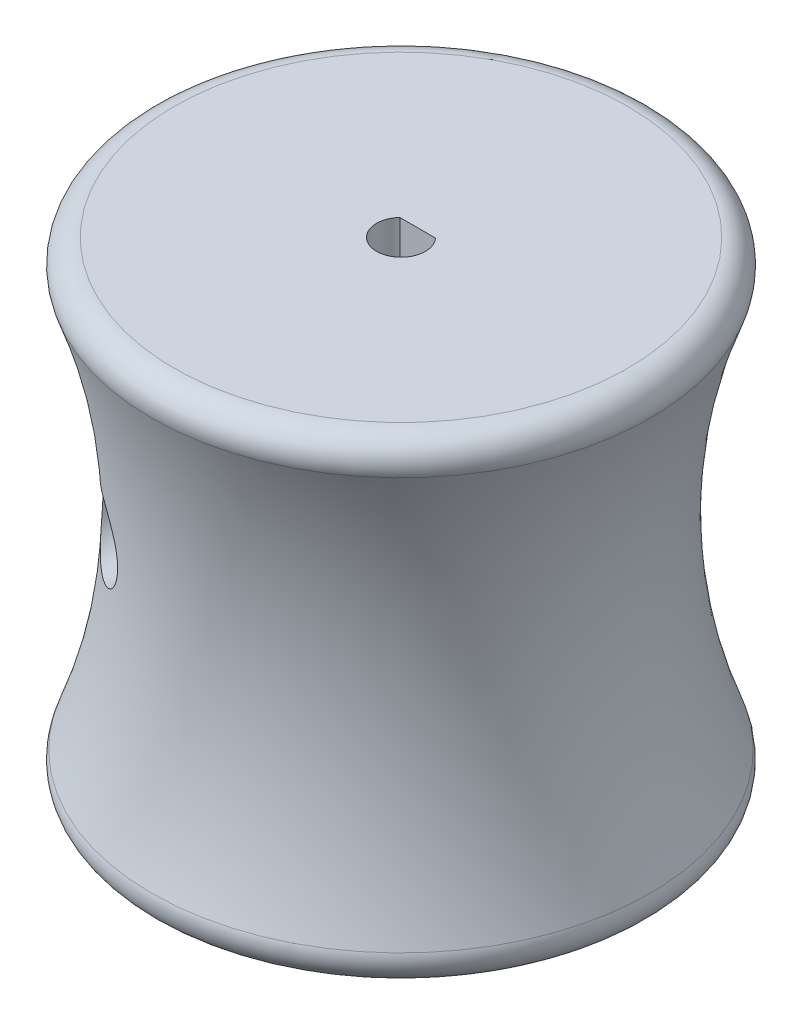
ISO-10303-21;
HEADER;
FILE_DESCRIPTION(('STEP AP214'),'2;1');
FILE_NAME('part.step','',(''),(''),'','','');
FILE_SCHEMA(('AUTOMOTIVE_DESIGN { 1 0 10303 214 1 1 1 1 }'));
ENDSEC;
DATA;
#1=APPLICATION_CONTEXT('core data for automotive mechanical design processes');
#2=APPLICATION_PROTOCOL_DEFINITION('international standard','automotive_design',2000,#1);
#3=PRODUCT_CONTEXT('',#1,'mechanical');
#4=PRODUCT('Part','Part','',(#3));
#5=PRODUCT_RELATED_PRODUCT_CATEGORY('part','',(#4));
#6=PRODUCT_DEFINITION_FORMATION('','',#4);
#7=PRODUCT_DEFINITION_CONTEXT('part definition',#1,'design');
#8=PRODUCT_DEFINITION('design','',#6,#7);
#9=PRODUCT_DEFINITION_SHAPE('','',#8);
#10=(LENGTH_UNIT() NAMED_UNIT(*) SI_UNIT(.MILLI.,.METRE.));
#11=(NAMED_UNIT(*) PLANE_ANGLE_UNIT() SI_UNIT($,.RADIAN.));
#12=(NAMED_UNIT(*) SI_UNIT($,.STERADIAN.) SOLID_ANGLE_UNIT());
#13=UNCERTAINTY_MEASURE_WITH_UNIT(LENGTH_MEASURE(1.E-05),#10,'distance_accuracy_value','');
#14=(GEOMETRIC_REPRESENTATION_CONTEXT(3) GLOBAL_UNCERTAINTY_ASSIGNED_CONTEXT((#13)) GLOBAL_UNIT_ASSIGNED_CONTEXT((#10,
#11,#12)) REPRESENTATION_CONTEXT('',''));
#15=CARTESIAN_POINT('',(0.,0.,0.));
#16=DIRECTION('',(0.,0.,1.));
#17=DIRECTION('',(1.,0.,0.));
#18=AXIS2_PLACEMENT_3D('',#15,#16,#17);
#19=CARTESIAN_POINT('',(-2.05,0.,0.));
#20=DIRECTION('',(0.,1.,0.));
#21=DIRECTION('',(0.,0.,1.));
#22=AXIS2_PLACEMENT_3D('',#19,#20,#21);
#23=PLANE('',#22);
#24=CARTESIAN_POINT('',(0.,0.,0.));
#25=DIRECTION('',(0.,1.,0.));
#26=DIRECTION('',(0.,0.,1.));
#27=AXIS2_PLACEMENT_3D('',#24,#25,#26);
#28=CIRCLE('',#27,19.0746635484357);
#29=CARTESIAN_POINT('',(0.,0.,19.0746635484357));
#30=VERTEX_POINT('',#29);
#31=EDGE_CURVE('E11',#30,#30,#28,.F.);
#32=ORIENTED_EDGE('',*,*,#31,.T.);
#33=EDGE_LOOP('',(#32));
#34=FACE_BOUND('',#33,.T.);
#35=CARTESIAN_POINT('',(0.,0.,0.));
#36=DIRECTION('',(0.,-1.,0.));
#37=DIRECTION('',(0.,0.,-1.));
#38=AXIS2_PLACEMENT_3D('',#35,#36,#37);
#39=CIRCLE('',#38,2.05);
#40=CARTESIAN_POINT('',(1.5,0.,-1.39731886124821));
#41=VERTEX_POINT('',#40);
#42=CARTESIAN_POINT('',(-1.5,0.,-1.39731886124821));
#43=VERTEX_POINT('',#42);
#44=EDGE_CURVE('E55',#41,#43,#39,.T.);
#45=ORIENTED_EDGE('',*,*,#44,.F.);
#46=DIRECTION('',(-1.,0.,0.));
#47=VECTOR('',#46,1.);
#48=CARTESIAN_POINT('',(-1.5,0.,-1.39731886124821));
#49=LINE('',#48,#47);
#50=EDGE_CURVE('E67',#41,#43,#49,.T.);
#51=ORIENTED_EDGE('',*,*,#50,.T.);
#52=EDGE_LOOP('',(#45,#51));
#53=FACE_BOUND('',#52,.T.);
#54=ADVANCED_FACE('F33',(#34,#53),#23,.F.);
#55=CARTESIAN_POINT('',(0.,20.,0.));
#56=DIRECTION('',(0.,-1.,0.));
#57=DIRECTION('',(0.,0.,-1.));
#58=AXIS2_PLACEMENT_3D('',#55,#56,#57);
#59=TOROIDAL_SURFACE('',#58,67.2000369326138,49.3814320875407);
#60=CARTESIAN_POINT('',(-8.41740148487917,18.2059411743486,-15.7420724041325));
#61=CARTESIAN_POINT('',(-8.32593708767405,18.328514955041,-15.7859282502121));
#62=CARTESIAN_POINT('',(-8.24297987107519,18.4593259564831,-15.8244350192102));
#63=CARTESIAN_POINT('',(-8.09745017921644,18.734362060283,-15.8906236835779));
#64=CARTESIAN_POINT('',(-8.03487312180446,18.8785841379881,-15.9183080124804));
#65=CARTESIAN_POINT('',(-7.93270419395248,19.1767579018185,-15.9629131088915));
#66=CARTESIAN_POINT('',(-7.89314315177229,19.3307223326519,-15.9798194429569));
#67=CARTESIAN_POINT('',(-7.83884067367383,19.6437642607484,-16.0029090430921));
#68=CARTESIAN_POINT('',(-7.82409956420845,19.8028418252358,-16.0090921681211));
#69=CARTESIAN_POINT('',(-7.82011242213963,20.1182935278861,-16.0107702149628));
#70=CARTESIAN_POINT('',(-7.83038053905276,20.2746606856367,-16.0064688167959));
#71=CARTESIAN_POINT('',(-7.87496804530724,20.5832720841031,-15.9875673809628));
#72=CARTESIAN_POINT('',(-7.90928546152177,20.735516661992,-15.9729681881795));
#73=CARTESIAN_POINT('',(-8.00045220886725,21.031327979962,-15.9334220557002));
#74=CARTESIAN_POINT('',(-8.0572561342106,21.1749115395835,-15.9084959638554));
#75=CARTESIAN_POINT('',(-8.19105800322196,21.4499449358191,-15.8482477781881));
#76=CARTESIAN_POINT('',(-8.26805637134713,21.5813945173166,-15.8129254658506));
#77=CARTESIAN_POINT('',(-8.44119856358103,21.8320084195719,-15.7310195718536));
#78=CARTESIAN_POINT('',(-8.53775342479176,21.9508071013989,-15.6841886048088));
#79=CARTESIAN_POINT('',(-8.74495309450607,22.1700889743099,-15.5801117766882));
#80=CARTESIAN_POINT('',(-8.85560059811625,22.2705686530686,-15.522863922565));
#81=CARTESIAN_POINT('',(-9.09429245109406,22.4576357962001,-15.3947100241208));
#82=CARTESIAN_POINT('',(-9.22299405516872,22.542946056912,-15.323169957364));
#83=CARTESIAN_POINT('',(-9.48725395962929,22.6910669515452,-15.1702492195439));
#84=CARTESIAN_POINT('',(-9.62281504324174,22.7538683676211,-15.088864535109));
#85=CARTESIAN_POINT('',(-9.91328773252321,22.8638148722802,-14.9073675560567));
#86=CARTESIAN_POINT('',(-10.0685723984714,22.9081840472378,-14.8061797038515));
#87=CARTESIAN_POINT('',(-10.3784658736752,22.9712729085447,-14.5952570126023));
#88=CARTESIAN_POINT('',(-10.5330743047683,22.9899797153856,-14.4855179110069));
#89=CARTESIAN_POINT('',(-10.8654727863174,23.0050709177595,-14.2395200517965));
#90=CARTESIAN_POINT('',(-11.0425330284706,22.9969280784295,-14.1020011277826));
#91=CARTESIAN_POINT('',(-11.3879374299377,22.9512635446106,-13.8210214149673));
#92=CARTESIAN_POINT('',(-11.5562732126361,22.9137141534309,-13.6775551453394));
#93=CARTESIAN_POINT('',(-11.9137720143448,22.8016649738324,-13.3593375659405));
#94=CARTESIAN_POINT('',(-12.1005944735328,22.721387224347,-13.1839414750631));
#95=CARTESIAN_POINT('',(-12.3666098107761,22.5737121790111,-12.9221016529725));
#96=CARTESIAN_POINT('',(-12.4529605343338,22.519902643399,-12.8349776279337));
#97=CARTESIAN_POINT('',(-12.6205628099525,22.4031323567332,-12.6619825407401));
#98=CARTESIAN_POINT('',(-12.7018157335757,22.3401740823944,-12.5761111463786));
#99=CARTESIAN_POINT('',(-12.9014672887518,22.1681374642704,-12.3604958133783));
#100=CARTESIAN_POINT('',(-13.016046595627,22.0525930982447,-12.23227920659));
#101=CARTESIAN_POINT('',(-13.2292192170751,21.797801806263,-11.98659773593));
#102=CARTESIAN_POINT('',(-13.3278439535904,21.658602604869,-11.8691119419237));
#103=CARTESIAN_POINT('',(-13.4752437780832,21.4047421701533,-11.6892303798827));
#104=CARTESIAN_POINT('',(-13.529711427109,21.2972195103593,-11.6214749764837));
#105=CARTESIAN_POINT('',(-13.6271370474271,21.0702966182412,-11.4986445286525));
#106=CARTESIAN_POINT('',(-13.6701130649888,20.9509154176163,-11.4435496217496));
#107=CARTESIAN_POINT('',(-13.7343675051321,20.7265936570132,-11.3604134819001));
#108=CARTESIAN_POINT('',(-13.7582767807403,20.6236193177936,-11.3291538054861));
#109=CARTESIAN_POINT('',(-13.7952696761076,20.4125510725841,-11.2805840029293));
#110=CARTESIAN_POINT('',(-13.8083648406028,20.304462756805,-11.2632590011706));
#111=CARTESIAN_POINT('',(-13.8226399899621,20.0855555894964,-11.2443658362231));
#112=CARTESIAN_POINT('',(-13.8237616044811,19.9747259992029,-11.2428748631666));
#113=CARTESIAN_POINT('',(-13.813823337031,19.7545776323405,-11.2560374237461));
#114=CARTESIAN_POINT('',(-13.802758958035,19.6452594286011,-11.2706969174289));
#115=CARTESIAN_POINT('',(-13.7705828929423,19.4385911948707,-11.3130230948414));
#116=CARTESIAN_POINT('',(-13.7501909926982,19.3409293246764,-11.3397564529943));
#117=CARTESIAN_POINT('',(-13.7009882121164,19.1513835118853,-11.4036795020193));
#118=CARTESIAN_POINT('',(-13.6721739201735,19.0595019290369,-11.4408734298571));
#119=CARTESIAN_POINT('',(-13.5875721240241,18.8278401793374,-11.5488653442493));
#120=CARTESIAN_POINT('',(-13.5260795352174,18.693239746975,-11.6262834550576));
#121=CARTESIAN_POINT('',(-13.3889360972209,18.4408967932764,-11.7950446779206));
#122=CARTESIAN_POINT('',(-13.3132408231945,18.3232092713475,-11.8864313114334));
#123=CARTESIAN_POINT('',(-13.1707174230639,18.1309483281807,-12.0541959207608));
#124=CARTESIAN_POINT('',(-13.1063054073738,18.0528995224725,-12.1287180887903));
#125=CARTESIAN_POINT('',(-12.971861464464,17.9053862177457,-12.2811910506776));
#126=CARTESIAN_POINT('',(-12.9018267476772,17.8359260237104,-12.3591435376304));
#127=CARTESIAN_POINT('',(-12.7566989159367,17.7052478804334,-12.5173193437874));
#128=CARTESIAN_POINT('',(-12.6816023458612,17.6440356483366,-12.5975441919551));
#129=CARTESIAN_POINT('',(-12.5268314977733,17.529720169909,-12.759296049599));
#130=CARTESIAN_POINT('',(-12.4471579231982,17.4766156820681,-12.8408228575945));
#131=CARTESIAN_POINT('',(-12.2806677919871,17.3767208025618,-13.007344373312));
#132=CARTESIAN_POINT('',(-12.193698407142,17.3302192158647,-13.0923599662199));
#133=CARTESIAN_POINT('',(-12.0155407016272,17.2459463014161,-13.2623124214205));
#134=CARTESIAN_POINT('',(-11.9243509235594,17.2081780168799,-13.3472492460278));
#135=CARTESIAN_POINT('',(-11.6450929922977,17.1084045820766,-13.6008299368414));
#136=CARTESIAN_POINT('',(-11.4510787572677,17.0597762081106,-13.7685035722866));
#137=CARTESIAN_POINT('',(-11.0667933795615,17.0042262006563,-14.0831457053391));
#138=CARTESIAN_POINT('',(-10.8774343596825,16.9943170408232,-14.2307041046347));
#139=CARTESIAN_POINT('',(-10.4926143183154,17.011926356534,-14.5154245579152));
#140=CARTESIAN_POINT('',(-10.2971597382319,17.0394065488632,-14.6525970943171));
#141=CARTESIAN_POINT('',(-9.94142125506341,17.1273333114221,-14.8894201140663));
#142=CARTESIAN_POINT('',(-9.78104540431204,17.1810715430192,-14.9914113155721));
#143=CARTESIAN_POINT('',(-9.46587593101015,17.318430402716,-15.1833460301864));
#144=CARTESIAN_POINT('',(-9.31107869398889,17.402031284692,-15.2732974504747));
#145=CARTESIAN_POINT('',(-9.02357917992515,17.5929293901311,-15.4335771240553));
#146=CARTESIAN_POINT('',(-8.89009169036557,17.6982703641736,-15.504814882592));
#147=CARTESIAN_POINT('',(-8.63976982268322,17.9340782249739,-15.6337596129665));
#148=CARTESIAN_POINT('',(-8.52292401808072,18.0645277256409,-15.6914758866302));
#149=CARTESIAN_POINT('',(-8.41740148487917,18.2059411743486,-15.7420724041325));
#150=B_SPLINE_CURVE_WITH_KNOTS('',3,(#60,#61,#62,#63,#64,#65,#66,#67,#68,#69,#70,#71,#72,#73,
#74,#75,#76,#77,#78,#79,#80,#81,#82,#83,#84,#85,#86,#87,#88,#89,#90,#91,#92,#93,#94,#95,#96,#97,
#98,#99,#100,#101,#102,#103,#104,#105,#106,#107,#108,#109,#110,#111,#112,#113,#114,#115,#116,
#117,#118,#119,#120,#121,#122,#123,#124,#125,#126,#127,#128,#129,#130,#131,#132,#133,#134,#135,
#136,#137,#138,#139,#140,#141,#142,#143,#144,#145,#146,#147,#148,#149),.UNSPECIFIED.,.T.,.F.,(4,
2,2,2,2,2,2,2,2,2,2,2,2,2,2,2,2,2,2,2,2,2,2,2,2,2,2,2,2,2,2,2,2,2,2,2,2,2,2,2,2,2,2,2,4),(0.,
0.476711109015459,0.953314963068647,1.43055573189315,1.90780277774572,2.37585261802226,
2.84386406160491,3.31093525651705,3.778016269358,4.25618335210887,4.73444201823431,
5.2428884171493,5.7515427982865,6.32111669667182,6.89097635010379,7.56150625802235,
8.23266846813504,9.0347208256465,9.43624064012665,9.83765195835664,10.4572815606777,
11.075675563903,11.4892912051946,11.9022534449841,12.231650840093,12.5606961267296,
12.8913447612998,13.2221154568391,13.5308120857717,13.8396339302,14.3378365915238,
14.837624384329,15.2141715062224,15.5909066111933,15.9679015244923,16.3448386518743,
16.735072084706,17.1254412944359,17.9050003260354,18.6230616246319,19.3403882483549,
19.9305403856142,20.5203030158864,21.0706646544333,21.6206465639605),.UNSPECIFIED.);
#151=CARTESIAN_POINT('',(-8.41740148487917,18.2059411743486,-15.7420724041325));
#152=VERTEX_POINT('',#151);
#153=EDGE_CURVE('E37',#152,#152,#150,.T.);
#154=ORIENTED_EDGE('',*,*,#153,.T.);
#155=EDGE_LOOP('',(#154));
#156=FACE_BOUND('',#155,.T.);
#157=CARTESIAN_POINT('',(-13.7918723551774,19.576974395709,11.2850127113582));
#158=CARTESIAN_POINT('',(-13.8075448286608,19.6870736151658,11.2643722601564));
#159=CARTESIAN_POINT('',(-13.8172832705202,19.7996324257664,11.2514560437942));
#160=CARTESIAN_POINT('',(-13.8238718514511,20.0258246167543,11.2427265600873));
#161=CARTESIAN_POINT('',(-13.8207148049753,20.139458561031,11.2469228280572));
#162=CARTESIAN_POINT('',(-13.8018744070801,20.3633507979615,11.2718361897264));
#163=CARTESIAN_POINT('',(-13.7862368699262,20.47361990824,11.2924928589885));
#164=CARTESIAN_POINT('',(-13.7438836652131,20.6882698324835,11.3479657434325));
#165=CARTESIAN_POINT('',(-13.7171570577835,20.7926447156778,11.3827959407881));
#166=CARTESIAN_POINT('',(-13.6431945798343,21.0297843597658,11.4780991366272));
#167=CARTESIAN_POINT('',(-13.5920438800568,21.1594041876739,11.5432871576033));
#168=CARTESIAN_POINT('',(-13.4764504085749,21.4040986637747,11.6877285241848));
#169=CARTESIAN_POINT('',(-13.4119756694986,21.5191372370662,11.7670156316382));
#170=CARTESIAN_POINT('',(-13.2892868527971,21.7091701733103,11.9145831126149));
#171=CARTESIAN_POINT('',(-13.2332847921798,21.7871484141847,11.9809372545472));
#172=CARTESIAN_POINT('',(-13.1159766968994,21.9354365269643,12.1174895158745));
#173=CARTESIAN_POINT('',(-13.0546679501368,22.0057424357626,12.1876895940131));
#174=CARTESIAN_POINT('',(-12.9273166628792,22.1390420311881,12.3308010320508));
#175=CARTESIAN_POINT('',(-12.8612705338419,22.2020300779122,12.4037144267201));
#176=CARTESIAN_POINT('',(-12.7249383862864,22.3208649556377,12.551299329476));
#177=CARTESIAN_POINT('',(-12.6546529882604,22.3767128280151,12.6259705792984));
#178=CARTESIAN_POINT('',(-12.4315573667516,22.5384223989217,12.8581796542974));
#179=CARTESIAN_POINT('',(-12.2720836501167,22.632667164052,13.0175710604073));
#180=CARTESIAN_POINT('',(-11.9382524263244,22.7906482997542,13.3360548534195));
#181=CARTESIAN_POINT('',(-11.7638870979691,22.854368521028,13.4951470377811));
#182=CARTESIAN_POINT('',(-11.4751432539413,22.9301376692826,13.7459977722945));
#183=CARTESIAN_POINT('',(-11.364698235635,22.9526601297228,13.8392125788771));
#184=CARTESIAN_POINT('',(-11.1399535367245,22.9852479575811,14.023260996256));
#185=CARTESIAN_POINT('',(-11.0256529418464,22.9953103487027,14.1140940330569));
#186=CARTESIAN_POINT('',(-10.794268616111,23.0021010964495,14.2923460886074));
#187=CARTESIAN_POINT('',(-10.677189265018,22.9988492095516,14.3797699715783));
#188=CARTESIAN_POINT('',(-10.4413129740152,22.9781210236231,14.5504001686481));
#189=CARTESIAN_POINT('',(-10.3225169893856,22.9606523576555,14.6336087205208));
#190=CARTESIAN_POINT('',(-10.0412030485831,22.901396956341,14.8243808123551));
#191=CARTESIAN_POINT('',(-9.87852073372846,22.8530701410964,14.9297759203649));
#192=CARTESIAN_POINT('',(-9.5576557915719,22.7260753886887,15.1286888000555));
#193=CARTESIAN_POINT('',(-9.39947000560706,22.6474293451611,15.22221507764));
#194=CARTESIAN_POINT('',(-9.17005440762693,22.5059484807065,15.352242916483));
#195=CARTESIAN_POINT('',(-9.09458654893476,22.4545980276669,15.3940320996235));
#196=CARTESIAN_POINT('',(-8.9474325949017,22.3441450536055,15.473816678933));
#197=CARTESIAN_POINT('',(-8.8757446522767,22.2850463693956,15.5118139365142));
#198=CARTESIAN_POINT('',(-8.73712884899839,22.1593301507632,15.5838197273126));
#199=CARTESIAN_POINT('',(-8.67020044282648,22.0927134802931,15.6178287179395));
#200=CARTESIAN_POINT('',(-8.54208470315478,21.9523590497604,15.6817163604576));
#201=CARTESIAN_POINT('',(-8.48089650250944,21.8786223687101,15.7115956365289));
#202=CARTESIAN_POINT('',(-8.372441544296,21.7342199328261,15.7636572942567));
#203=CARTESIAN_POINT('',(-8.32439045115747,21.6643199657171,15.7863348865297));
#204=CARTESIAN_POINT('',(-8.23399107837474,21.5199527489823,15.8284248752671));
#205=CARTESIAN_POINT('',(-8.1916447968368,21.4454839123358,15.8478361282883));
#206=CARTESIAN_POINT('',(-8.11325018969326,21.2926213690148,15.8833526821223));
#207=CARTESIAN_POINT('',(-8.07719671538896,21.2142309391553,15.8994606875179));
#208=CARTESIAN_POINT('',(-8.01180209648661,21.0541069144656,15.9283948157158));
#209=CARTESIAN_POINT('',(-7.98246327905211,20.9723721720988,15.941219800872));
#210=CARTESIAN_POINT('',(-7.90946748499304,20.737124191571,15.972898902279));
#211=CARTESIAN_POINT('',(-7.87415991685817,20.5803827056532,15.9879123147902));
#212=CARTESIAN_POINT('',(-7.82906591929681,20.2627263554218,16.0070236080564));
#213=CARTESIAN_POINT('',(-7.81927337330173,20.1018125006695,16.0111241049065));
#214=CARTESIAN_POINT('',(-7.82548269087953,19.7852249137918,16.008509238128));
#215=CARTESIAN_POINT('',(-7.84074726999742,19.629534139764,16.0021030301253));
#216=CARTESIAN_POINT('',(-7.89505752809442,19.3231645109857,15.9790005063759));
#217=CARTESIAN_POINT('',(-7.93410161364905,19.1724853211307,15.9623048801048));
#218=CARTESIAN_POINT('',(-8.03436725178568,18.8802563980719,15.9185270088142));
#219=CARTESIAN_POINT('',(-8.09559614647665,18.7387097055787,15.8914413250091));
#220=CARTESIAN_POINT('',(-8.23771224975238,18.4684780575717,15.8268550328811));
#221=CARTESIAN_POINT('',(-8.31860017928136,18.3397935739905,15.7893540425966));
#222=CARTESIAN_POINT('',(-8.49921972692405,18.0949643028375,15.7029284767678));
#223=CARTESIAN_POINT('',(-8.5994003121687,17.9792507610186,15.6537233513216));
#224=CARTESIAN_POINT('',(-8.81314033653546,17.7666526598523,15.5449264556356));
#225=CARTESIAN_POINT('',(-8.92670258251081,17.6697720621174,15.4853325050398));
#226=CARTESIAN_POINT('',(-9.17124184563671,17.4900051055794,15.3521111970032));
#227=CARTESIAN_POINT('',(-9.30287842112586,17.4085248486491,15.2778037127589));
#228=CARTESIAN_POINT('',(-9.57224741898577,17.2684094924795,15.1194442666017));
#229=CARTESIAN_POINT('',(-9.70998246549854,17.2097843361781,15.0353880841782));
#230=CARTESIAN_POINT('',(-10.0051900902781,17.1085657514618,14.8478463018853));
#231=CARTESIAN_POINT('',(-10.1629618249755,17.0689252972975,14.7432471994504));
#232=CARTESIAN_POINT('',(-10.4770402361351,17.0156202248413,14.5256852961231));
#233=CARTESIAN_POINT('',(-10.6333461653529,17.001968207392,14.4127184655889));
#234=CARTESIAN_POINT('',(-10.969363170635,16.9981066001488,14.1594695077516));
#235=CARTESIAN_POINT('',(-11.1481850106518,17.0125914723901,14.0179461955169));
#236=CARTESIAN_POINT('',(-11.4963218802514,17.071466124682,13.7292788803905));
#237=CARTESIAN_POINT('',(-11.6656260964084,17.115889203604,13.5821287911855));
#238=CARTESIAN_POINT('',(-11.9263029493042,17.2087885106898,13.3455096721279));
#239=CARTESIAN_POINT('',(-12.0215647174557,17.248402478401,13.2567152867298));
#240=CARTESIAN_POINT('',(-12.2074627007627,17.3371674192977,13.0790637400885));
#241=CARTESIAN_POINT('',(-12.2980999221361,17.3863163065841,12.990206596803));
#242=CARTESIAN_POINT('',(-12.474378134051,17.4940437635398,12.8132197564637));
#243=CARTESIAN_POINT('',(-12.5600184374173,17.5526236260105,12.7250901608861));
#244=CARTESIAN_POINT('',(-12.7258090395959,17.6792670146232,12.5505750832088));
#245=CARTESIAN_POINT('',(-12.8059612923973,17.747327138907,12.4641889881528));
#246=CARTESIAN_POINT('',(-12.9929139647184,17.924102973879,12.2583465968039));
#247=CARTESIAN_POINT('',(-13.0966548588628,18.0378421206257,12.1403489960547));
#248=CARTESIAN_POINT('',(-13.2894342982549,18.2866045424043,11.915132063802));
#249=CARTESIAN_POINT('',(-13.3784931943084,18.4215978404216,11.8078978951297));
#250=CARTESIAN_POINT('',(-13.5138758585679,18.6708443336437,11.641298671497));
#251=CARTESIAN_POINT('',(-13.5650241415292,18.7792799439701,11.5771941835178));
#252=CARTESIAN_POINT('',(-13.6555178715915,19.0074031600844,11.4623652283378));
#253=CARTESIAN_POINT('',(-13.6949050103008,19.1270489961592,11.411593577189));
#254=CARTESIAN_POINT('',(-13.7405422586063,19.3041679199414,11.3522868689755));
#255=CARTESIAN_POINT('',(-13.7527978324904,19.3576719908582,11.3362866184913));
#256=CARTESIAN_POINT('',(-13.7745006931337,19.4662315678913,11.3078677420467));
#257=CARTESIAN_POINT('',(-13.7839455273797,19.5212883832731,11.2954522442448));
#258=CARTESIAN_POINT('',(-13.7918723551774,19.576974395709,11.2850127113582));
#259=B_SPLINE_CURVE_WITH_KNOTS('',3,(#157,#158,#159,#160,#161,#162,#163,#164,#165,#166,#167,
#168,#169,#170,#171,#172,#173,#174,#175,#176,#177,#178,#179,#180,#181,#182,#183,#184,#185,#186,
#187,#188,#189,#190,#191,#192,#193,#194,#195,#196,#197,#198,#199,#200,#201,#202,#203,#204,#205,
#206,#207,#208,#209,#210,#211,#212,#213,#214,#215,#216,#217,#218,#219,#220,#221,#222,#223,#224,
#225,#226,#227,#228,#229,#230,#231,#232,#233,#234,#235,#236,#237,#238,#239,#240,#241,#242,#243,
#244,#245,#246,#247,#248,#249,#250,#251,#252,#253,#254,#255,#256,#257,#258),.UNSPECIFIED.,.T.,
.F.,(4,2,2,2,2,2,2,2,2,2,2,2,2,2,2,2,2,2,2,2,2,2,2,2,2,2,2,2,2,2,2,2,2,2,2,2,2,2,2,2,2,2,2,2,2,
2,2,2,2,2,4),(0.,0.339074557084504,0.678338077043677,1.01636190119724,1.35471999709693,
1.81370779406817,2.27380986435557,2.6234719555724,2.97331381659431,3.32342353806852,
3.67348213855315,4.40402427215917,5.13495248028525,5.57323594187065,6.01162407462234,
6.44936193826197,6.88686493308092,7.48372582290388,8.08015652196696,8.38096335480478,
8.68162179111552,8.98224571145966,9.28282414460081,9.54587887382049,9.8090254995572,
10.0719558022213,10.3349770936503,10.8164740187125,11.2978555066791,11.7653249770855,
12.2327631265995,12.7003561172625,13.1679662582764,13.648174580771,14.1284838086521,
14.6415691857852,15.1548775283859,15.7329001013507,16.3112028650086,16.9942625446078,
17.6780832162543,18.0860817738891,18.4939911764859,18.9019565431311,19.3097758924864,
19.8900050629556,20.4694230861816,20.8760756973583,21.2812691855186,21.452617330456,
21.6241145499244),.UNSPECIFIED.);
#260=CARTESIAN_POINT('',(-13.7918723551774,19.576974395709,11.2850127113582));
#261=VERTEX_POINT('',#260);
#262=EDGE_CURVE('E89',#261,#261,#259,.T.);
#263=ORIENTED_EDGE('',*,*,#262,.T.);
#264=EDGE_LOOP('',(#263));
#265=FACE_BOUND('',#264,.T.);
#266=CARTESIAN_POINT('',(0.,37.2993577925453,0.));
#267=DIRECTION('',(0.,-1.,0.));
#268=DIRECTION('',(0.,0.,-1.));
#269=AXIS2_PLACEMENT_3D('',#266,#267,#268);
#270=CIRCLE('',#269,20.9479228730176);
#271=CARTESIAN_POINT('',(0.,37.2993577925453,-20.9479228730176));
#272=VERTEX_POINT('',#271);
#273=EDGE_CURVE('E85',#272,#272,#270,.T.);
#274=ORIENTED_EDGE('',*,*,#273,.T.);
#275=EDGE_LOOP('',(#274));
#276=FACE_BOUND('',#275,.T.);
#277=CARTESIAN_POINT('',(0.,2.70064220745474,0.));
#278=DIRECTION('',(0.,1.,0.));
#279=DIRECTION('',(0.,0.,1.));
#280=AXIS2_PLACEMENT_3D('',#277,#278,#279);
#281=CIRCLE('',#280,20.9479228730176);
#282=CARTESIAN_POINT('',(0.,2.70064220745474,20.9479228730176));
#283=VERTEX_POINT('',#282);
#284=EDGE_CURVE('E82',#283,#283,#281,.T.);
#285=ORIENTED_EDGE('',*,*,#284,.T.);
#286=EDGE_LOOP('',(#285));
#287=FACE_BOUND('',#286,.T.);
#288=ADVANCED_FACE('F94',(#156,#265,#276,#287),#59,.F.);
#289=CARTESIAN_POINT('',(-2.05,40.,0.));
#290=DIRECTION('',(0.,-1.,0.));
#291=DIRECTION('',(0.,0.,-1.));
#292=AXIS2_PLACEMENT_3D('',#289,#290,#291);
#293=PLANE('',#292);
#294=CARTESIAN_POINT('',(0.,40.,0.));
#295=DIRECTION('',(0.,-1.,0.));
#296=DIRECTION('',(0.,0.,-1.));
#297=AXIS2_PLACEMENT_3D('',#294,#295,#296);
#298=CIRCLE('',#297,19.0746635484358);
#299=CARTESIAN_POINT('',(0.,40.,-19.0746635484358));
#300=VERTEX_POINT('',#299);
#301=EDGE_CURVE('E47',#300,#300,#298,.F.);
#302=ORIENTED_EDGE('',*,*,#301,.T.);
#303=EDGE_LOOP('',(#302));
#304=FACE_BOUND('',#303,.T.);
#305=CARTESIAN_POINT('',(0.,40.,0.));
#306=DIRECTION('',(0.,-1.,0.));
#307=DIRECTION('',(0.,0.,-1.));
#308=AXIS2_PLACEMENT_3D('',#305,#306,#307);
#309=CIRCLE('',#308,2.05);
#310=CARTESIAN_POINT('',(1.5,40.,-1.39731886124821));
#311=VERTEX_POINT('',#310);
#312=CARTESIAN_POINT('',(-1.5,40.,-1.39731886124821));
#313=VERTEX_POINT('',#312);
#314=EDGE_CURVE('E68',#311,#313,#309,.T.);
#315=ORIENTED_EDGE('',*,*,#314,.T.);
#316=DIRECTION('',(1.,0.,0.));
#317=VECTOR('',#316,1.);
#318=CARTESIAN_POINT('',(-1.5,40.,-1.39731886124821));
#319=LINE('',#318,#317);
#320=EDGE_CURVE('E182',#313,#311,#319,.T.);
#321=ORIENTED_EDGE('',*,*,#320,.T.);
#322=EDGE_LOOP('',(#315,#321));
#323=FACE_BOUND('',#322,.T.);
#324=ADVANCED_FACE('F108',(#304,#323),#293,.F.);
#325=CARTESIAN_POINT('',(0.,0.,0.));
#326=DIRECTION('',(0.,-1.,0.));
#327=DIRECTION('',(0.,0.,-1.));
#328=AXIS2_PLACEMENT_3D('',#325,#326,#327);
#329=CYLINDRICAL_SURFACE('',#328,2.05);
#330=ORIENTED_EDGE('',*,*,#44,.T.);
#331=DIRECTION('',(0.,1.,0.));
#332=VECTOR('',#331,1.);
#333=CARTESIAN_POINT('',(-1.5,-3.07017795394376,-1.39731886124821));
#334=LINE('',#333,#332);
#335=EDGE_CURVE('E60',#43,#313,#334,.T.);
#336=ORIENTED_EDGE('',*,*,#335,.T.);
#337=ORIENTED_EDGE('',*,*,#314,.F.);
#338=DIRECTION('',(0.,1.,0.));
#339=VECTOR('',#338,1.);
#340=CARTESIAN_POINT('',(1.5,-3.07017795394376,-1.39731886124821));
#341=LINE('',#340,#339);
#342=EDGE_CURVE('E71',#41,#311,#341,.T.);
#343=ORIENTED_EDGE('',*,*,#342,.F.);
#344=EDGE_LOOP('',(#330,#336,#337,#343));
#345=FACE_BOUND('',#344,.T.);
#346=ADVANCED_FACE('F72',(#345),#329,.F.);
#347=CARTESIAN_POINT('',(0.,38.,0.));
#348=DIRECTION('',(0.,1.,0.));
#349=DIRECTION('',(0.,0.,1.));
#350=AXIS2_PLACEMENT_3D('',#347,#348,#349);
#351=TOROIDAL_SURFACE('',#350,19.0746635484358,2.);
#352=ORIENTED_EDGE('',*,*,#301,.F.);
#353=EDGE_LOOP('',(#352));
#354=FACE_BOUND('',#353,.T.);
#355=ORIENTED_EDGE('',*,*,#273,.F.);
#356=EDGE_LOOP('',(#355));
#357=FACE_BOUND('',#356,.T.);
#358=ADVANCED_FACE('F107',(#354,#357),#351,.T.);
#359=CARTESIAN_POINT('',(0.,2.00000000000001,0.));
#360=DIRECTION('',(0.,-1.,0.));
#361=DIRECTION('',(0.,0.,-1.));
#362=AXIS2_PLACEMENT_3D('',#359,#360,#361);
#363=TOROIDAL_SURFACE('',#362,19.0746635484357,2.);
#364=ORIENTED_EDGE('',*,*,#284,.F.);
#365=EDGE_LOOP('',(#364));
#366=FACE_BOUND('',#365,.T.);
#367=ORIENTED_EDGE('',*,*,#31,.F.);
#368=EDGE_LOOP('',(#367));
#369=FACE_BOUND('',#368,.T.);
#370=ADVANCED_FACE('F35',(#366,#369),#363,.T.);
#371=CARTESIAN_POINT('',(-1.5,-3.07017795394376,-1.39731886124821));
#372=DIRECTION('',(0.,0.,1.));
#373=DIRECTION('',(1.,0.,0.));
#374=AXIS2_PLACEMENT_3D('',#371,#372,#373);
#375=PLANE('',#374);
#376=ORIENTED_EDGE('',*,*,#50,.F.);
#377=ORIENTED_EDGE('',*,*,#342,.T.);
#378=ORIENTED_EDGE('',*,*,#320,.F.);
#379=ORIENTED_EDGE('',*,*,#335,.F.);
#380=EDGE_LOOP('',(#376,#377,#378,#379));
#381=FACE_BOUND('',#380,.T.);
#382=ADVANCED_FACE('F77',(#381),#375,.T.);
#383=CARTESIAN_POINT('',(-10.8218472141871,20.,-21.0746635484358));
#384=DIRECTION('',(0.,0.,1.));
#385=DIRECTION('',(1.,0.,0.));
#386=AXIS2_PLACEMENT_3D('',#383,#384,#385);
#387=CYLINDRICAL_SURFACE('',#386,3.);
#388=ORIENTED_EDGE('',*,*,#262,.F.);
#389=EDGE_LOOP('',(#388));
#390=FACE_BOUND('',#389,.T.);
#391=ORIENTED_EDGE('',*,*,#153,.F.);
#392=EDGE_LOOP('',(#391));
#393=FACE_BOUND('',#392,.T.);
#394=ADVANCED_FACE('F98',(#390,#393),#387,.F.);
#395=CLOSED_SHELL('',(#54,#288,#324,#346,#358,#370,#382,#394));
#396=MANIFOLD_SOLID_BREP('B2',#395);
#397=ADVANCED_BREP_SHAPE_REPRESENTATION('',(#18,#396),#14);
#398=SHAPE_DEFINITION_REPRESENTATION(#9,#397);
ENDSEC;
END-ISO-10303-21;
